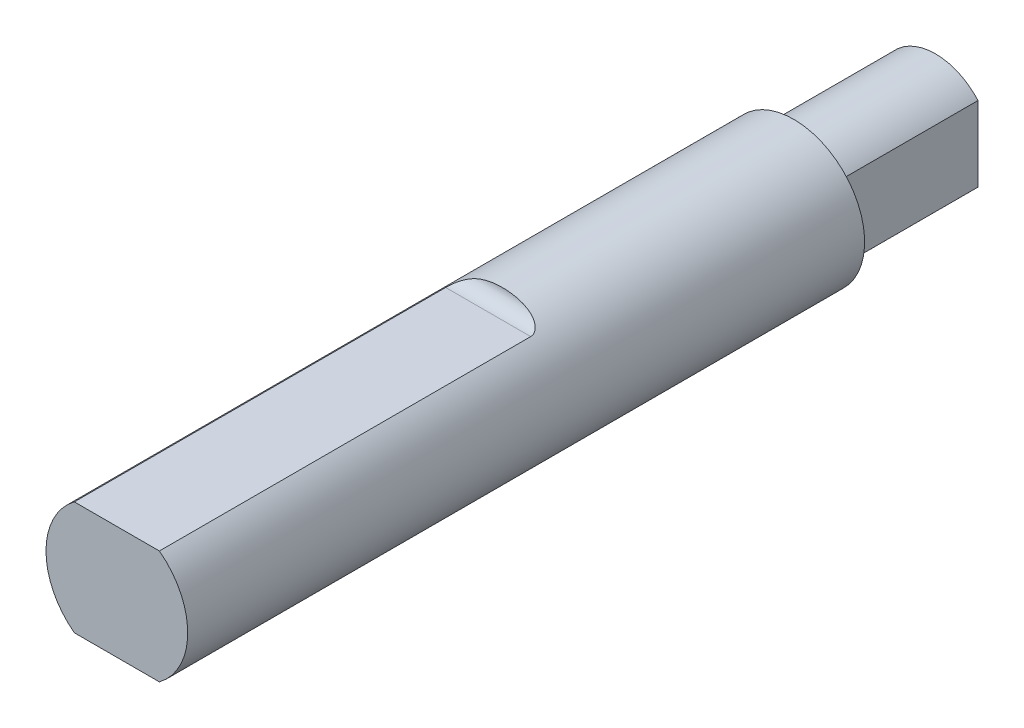
ISO-10303-21;
HEADER;
FILE_DESCRIPTION(('STEP AP214'),'2;1');
FILE_NAME('part.step','',(''),(''),'','','');
FILE_SCHEMA(('AUTOMOTIVE_DESIGN { 1 0 10303 214 1 1 1 1 }'));
ENDSEC;
DATA;
#1=APPLICATION_CONTEXT('core data for automotive mechanical design processes');
#2=APPLICATION_PROTOCOL_DEFINITION('international standard','automotive_design',2000,#1);
#3=PRODUCT_CONTEXT('',#1,'mechanical');
#4=PRODUCT('Part','Part','',(#3));
#5=PRODUCT_RELATED_PRODUCT_CATEGORY('part','',(#4));
#6=PRODUCT_DEFINITION_FORMATION('','',#4);
#7=PRODUCT_DEFINITION_CONTEXT('part definition',#1,'design');
#8=PRODUCT_DEFINITION('design','',#6,#7);
#9=PRODUCT_DEFINITION_SHAPE('','',#8);
#10=(LENGTH_UNIT() NAMED_UNIT(*) SI_UNIT(.MILLI.,.METRE.));
#11=(NAMED_UNIT(*) PLANE_ANGLE_UNIT() SI_UNIT($,.RADIAN.));
#12=(NAMED_UNIT(*) SI_UNIT($,.STERADIAN.) SOLID_ANGLE_UNIT());
#13=UNCERTAINTY_MEASURE_WITH_UNIT(LENGTH_MEASURE(1.E-05),#10,'distance_accuracy_value','');
#14=(GEOMETRIC_REPRESENTATION_CONTEXT(3) GLOBAL_UNCERTAINTY_ASSIGNED_CONTEXT((#13)) GLOBAL_UNIT_ASSIGNED_CONTEXT((#10,
#11,#12)) REPRESENTATION_CONTEXT('',''));
#15=CARTESIAN_POINT('',(0.,0.,0.));
#16=DIRECTION('',(0.,0.,1.));
#17=DIRECTION('',(1.,0.,0.));
#18=AXIS2_PLACEMENT_3D('',#15,#16,#17);
#19=CARTESIAN_POINT('',(0.,0.,28.879));
#20=DIRECTION('',(0.,0.,-1.));
#21=DIRECTION('',(-1.,0.,0.));
#22=AXIS2_PLACEMENT_3D('',#19,#20,#21);
#23=CYLINDRICAL_SURFACE('',#22,2.5);
#24=DIRECTION('',(0.,0.,1.));
#25=VECTOR('',#24,1.);
#26=CARTESIAN_POINT('',(-1.5,2.,15.779));
#27=LINE('',#26,#25);
#28=CARTESIAN_POINT('',(-1.5,2.,15.779));
#29=VERTEX_POINT('',#28);
#30=CARTESIAN_POINT('',(-1.5,2.,28.879));
#31=VERTEX_POINT('',#30);
#32=EDGE_CURVE('E63',#29,#31,#27,.T.);
#33=ORIENTED_EDGE('',*,*,#32,.F.);
#34=CARTESIAN_POINT('',(-1.5,2.,15.779));
#35=CARTESIAN_POINT('',(-1.50003764789676,1.99996204260842,15.7591270939918));
#36=CARTESIAN_POINT('',(-1.49842384435408,2.00118246531402,15.7393121678149));
#37=CARTESIAN_POINT('',(-1.49222650560307,2.00581270427297,15.7006130488765));
#38=CARTESIAN_POINT('',(-1.48767283056031,2.00920050346558,15.6817215300121));
#39=CARTESIAN_POINT('',(-1.47593572021465,2.01783617161018,15.645318845422));
#40=CARTESIAN_POINT('',(-1.46876053417294,2.02307820410837,15.6278035568533));
#41=CARTESIAN_POINT('',(-1.45219399215916,2.03500319732234,15.5943551798525));
#42=CARTESIAN_POINT('',(-1.44279713865559,2.04168972886228,15.5784261578861));
#43=CARTESIAN_POINT('',(-1.41781987066032,2.05915123933595,15.5418936731018));
#44=CARTESIAN_POINT('',(-1.40130908276452,2.07045575891846,15.5221823898567));
#45=CARTESIAN_POINT('',(-1.36562651076482,2.09416516504227,15.4861433388162));
#46=CARTESIAN_POINT('',(-1.34644955520267,2.10657217273916,15.4698223042075));
#47=CARTESIAN_POINT('',(-1.29422204293539,2.13925428967746,15.4313992900839));
#48=CARTESIAN_POINT('',(-1.25968293240487,2.15983618200008,15.4116007286691));
#49=CARTESIAN_POINT('',(-1.18753543304728,2.20033839558916,15.3778789861883));
#50=CARTESIAN_POINT('',(-1.1499202794411,2.22025711538361,15.3639691940692));
#51=CARTESIAN_POINT('',(-1.0753576538674,2.25725860017116,15.3413802680839));
#52=CARTESIAN_POINT('',(-1.03854738167487,2.27444227625866,15.3324034154042));
#53=CARTESIAN_POINT('',(-0.96362235810871,2.30718585547751,15.317320756555));
#54=CARTESIAN_POINT('',(-0.925506516753108,2.32274435564197,15.311217415323));
#55=CARTESIAN_POINT('',(-0.848234331199601,2.35206509731221,15.3011340715266));
#56=CARTESIAN_POINT('',(-0.809075990847351,2.36582354201172,15.2971585041484));
#57=CARTESIAN_POINT('',(-0.73000369223297,2.39140608562468,15.2907577129461));
#58=CARTESIAN_POINT('',(-0.690089500427336,2.40322957542402,15.2883329766199));
#59=CARTESIAN_POINT('',(-0.583695335636581,2.43187055653851,15.2833297945902));
#60=CARTESIAN_POINT('',(-0.516707751199021,2.44698125357976,15.2816635826573));
#61=CARTESIAN_POINT('',(-0.381680218624534,2.47164650838421,15.2796526372327));
#62=CARTESIAN_POINT('',(-0.313639732703522,2.48119812368875,15.2793086030396));
#63=CARTESIAN_POINT('',(-0.176894947888979,2.49468126945345,15.2789823404449));
#64=CARTESIAN_POINT('',(-0.10818978457339,2.49860407856408,15.2790006728511));
#65=CARTESIAN_POINT('',(0.0292885285896076,2.50077334188055,15.2789995207859));
#66=CARTESIAN_POINT('',(0.098061651711552,2.49902150622101,15.2789800477085));
#67=CARTESIAN_POINT('',(0.236189368361689,2.48979370240751,15.279082500772));
#68=CARTESIAN_POINT('',(0.305538646297269,2.48223803844602,15.2792064078503));
#69=CARTESIAN_POINT('',(0.443413184509917,2.46135085579352,15.2803859651072));
#70=CARTESIAN_POINT('',(0.511937799208332,2.44801508060984,15.2814423025259));
#71=CARTESIAN_POINT('',(0.647193526035153,2.41577096481712,15.2858782516794));
#72=CARTESIAN_POINT('',(0.713932477602935,2.39689394184407,15.2892449452257));
#73=CARTESIAN_POINT('',(0.845235409225721,2.35378975438525,15.3003329551466));
#74=CARTESIAN_POINT('',(0.909803301209289,2.32957288093341,15.3080459391723));
#75=CARTESIAN_POINT('',(1.00689724559128,2.28856751254539,15.3256358174016));
#76=CARTESIAN_POINT('',(1.04059295437449,2.27343566004815,15.3329168780388));
#77=CARTESIAN_POINT('',(1.10672545283644,2.24198499092013,15.3503358115405));
#78=CARTESIAN_POINT('',(1.13916133991401,2.22566534650348,15.3604756911685));
#79=CARTESIAN_POINT('',(1.20248836052356,2.19210295314736,15.3845013814871));
#80=CARTESIAN_POINT('',(1.23336626785886,2.17485426056167,15.3984143902443));
#81=CARTESIAN_POINT('',(1.29249277747563,2.14023972682707,15.430954183292));
#82=CARTESIAN_POINT('',(1.32074607515019,2.12287415690563,15.4495723190686));
#83=CARTESIAN_POINT('',(1.36369129375408,2.09540988527656,15.4847121544341));
#84=CARTESIAN_POINT('',(1.37956695997829,2.08497392165534,15.4995152181738));
#85=CARTESIAN_POINT('',(1.4092206933471,2.06504576865738,15.5316703225722));
#86=CARTESIAN_POINT('',(1.42300046190452,2.05555281595633,15.5490202729831));
#87=CARTESIAN_POINT('',(1.44584560582323,2.03953294763964,15.5833731471273));
#88=CARTESIAN_POINT('',(1.45531182404524,2.03277437722238,15.5999982476329));
#89=CARTESIAN_POINT('',(1.47181688912402,2.02085578581294,15.6349164154415));
#90=CARTESIAN_POINT('',(1.47886172980617,2.01569182083874,15.6532052202788));
#91=CARTESIAN_POINT('',(1.48951213878094,2.00783355471162,15.6891519913855));
#92=CARTESIAN_POINT('',(1.49339609193229,2.00494045583067,15.7066826682146));
#93=CARTESIAN_POINT('',(1.49866389863576,2.00100224145652,15.7424586097079));
#94=CARTESIAN_POINT('',(1.50002727049885,1.99997226674316,15.7607085083218));
#95=CARTESIAN_POINT('',(1.5,2.,15.779));
#96=B_SPLINE_CURVE_WITH_KNOTS('',3,(#34,#35,#36,#37,#38,#39,#40,#41,#42,#43,#44,#45,#46,#47,#48,
#49,#50,#51,#52,#53,#54,#55,#56,#57,#58,#59,#60,#61,#62,#63,#64,#65,#66,#67,#68,#69,#70,#71,#72,
#73,#74,#75,#76,#77,#78,#79,#80,#81,#82,#83,#84,#85,#86,#87,#88,#89,#90,#91,#92,#93,#94,#95),
.UNSPECIFIED.,.F.,.F.,(4,2,2,2,2,2,2,2,2,2,2,2,2,2,2,2,2,2,2,2,2,2,2,2,2,2,2,2,2,2,4),(0.,
0.0594240604100847,0.118253851146156,0.176900091122947,0.235692999194088,0.319483748208466,
0.403439351080197,0.537132622114268,0.671128252066819,0.7957551739251,0.920488808552722,
1.0454814384435,1.17051334001495,1.37630110705272,1.58219770008408,1.78841296891251,
1.99456609762952,2.20360178523934,2.41279166964385,2.62082131363628,2.82845349062703,
2.94128618701052,3.05419828496204,3.167946982397,3.28148809957396,3.35355280648448,
3.42555869666673,3.48619425822216,3.54667862420211,3.60096715275308,3.65569491121139),.UNSPECIFIED.);
#97=CARTESIAN_POINT('',(1.5,2.,15.779));
#98=VERTEX_POINT('',#97);
#99=EDGE_CURVE('E106',#29,#98,#96,.T.);
#100=ORIENTED_EDGE('',*,*,#99,.T.);
#101=DIRECTION('',(0.,0.,1.));
#102=VECTOR('',#101,1.);
#103=CARTESIAN_POINT('',(1.5,2.,15.779));
#104=LINE('',#103,#102);
#105=CARTESIAN_POINT('',(1.5,2.,28.879));
#106=VERTEX_POINT('',#105);
#107=EDGE_CURVE('E111',#98,#106,#104,.T.);
#108=ORIENTED_EDGE('',*,*,#107,.T.);
#109=CARTESIAN_POINT('',(0.,0.,28.879));
#110=DIRECTION('',(0.,0.,1.));
#111=DIRECTION('',(1.,0.,0.));
#112=AXIS2_PLACEMENT_3D('',#109,#110,#111);
#113=CIRCLE('',#112,2.5);
#114=CARTESIAN_POINT('',(1.5,-2.,28.879));
#115=VERTEX_POINT('',#114);
#116=EDGE_CURVE('E44',#115,#106,#113,.T.);
#117=ORIENTED_EDGE('',*,*,#116,.F.);
#118=DIRECTION('',(0.,0.,1.));
#119=VECTOR('',#118,1.);
#120=CARTESIAN_POINT('',(1.5,-2.,15.779));
#121=LINE('',#120,#119);
#122=CARTESIAN_POINT('',(1.5,-2.,15.779));
#123=VERTEX_POINT('',#122);
#124=EDGE_CURVE('E55',#123,#115,#121,.T.);
#125=ORIENTED_EDGE('',*,*,#124,.F.);
#126=CARTESIAN_POINT('',(1.5,-2.,15.779));
#127=CARTESIAN_POINT('',(1.50003764789676,-1.99996204260842,15.7591270939918));
#128=CARTESIAN_POINT('',(1.49842384435408,-2.00118246531402,15.7393121678149));
#129=CARTESIAN_POINT('',(1.49222650560307,-2.00581270427297,15.7006130488765));
#130=CARTESIAN_POINT('',(1.48767283056031,-2.00920050346558,15.6817215300121));
#131=CARTESIAN_POINT('',(1.47593572021465,-2.01783617161018,15.645318845422));
#132=CARTESIAN_POINT('',(1.46876053417294,-2.02307820410837,15.6278035568533));
#133=CARTESIAN_POINT('',(1.45219399215916,-2.03500319732234,15.5943551798525));
#134=CARTESIAN_POINT('',(1.44279713865559,-2.04168972886228,15.5784261578861));
#135=CARTESIAN_POINT('',(1.41781987066032,-2.05915123933595,15.5418936731018));
#136=CARTESIAN_POINT('',(1.40130908276452,-2.07045575891846,15.5221823898567));
#137=CARTESIAN_POINT('',(1.36562651076482,-2.09416516504227,15.4861433388162));
#138=CARTESIAN_POINT('',(1.34644955520267,-2.10657217273916,15.4698223042075));
#139=CARTESIAN_POINT('',(1.29422204293539,-2.13925428967746,15.4313992900839));
#140=CARTESIAN_POINT('',(1.25968293240487,-2.15983618200008,15.4116007286691));
#141=CARTESIAN_POINT('',(1.18753543304728,-2.20033839558916,15.3778789861883));
#142=CARTESIAN_POINT('',(1.1499202794411,-2.22025711538361,15.3639691940692));
#143=CARTESIAN_POINT('',(1.0753576538674,-2.25725860017116,15.3413802680839));
#144=CARTESIAN_POINT('',(1.03854738167487,-2.27444227625866,15.3324034154042));
#145=CARTESIAN_POINT('',(0.96362235810871,-2.30718585547751,15.317320756555));
#146=CARTESIAN_POINT('',(0.925506516753108,-2.32274435564197,15.311217415323));
#147=CARTESIAN_POINT('',(0.848234331199601,-2.35206509731221,15.3011340715266));
#148=CARTESIAN_POINT('',(0.809075990847351,-2.36582354201172,15.2971585041484));
#149=CARTESIAN_POINT('',(0.73000369223297,-2.39140608562468,15.2907577129461));
#150=CARTESIAN_POINT('',(0.690089500427336,-2.40322957542402,15.2883329766199));
#151=CARTESIAN_POINT('',(0.583695335636581,-2.43187055653851,15.2833297945902));
#152=CARTESIAN_POINT('',(0.516707751199021,-2.44698125357976,15.2816635826573));
#153=CARTESIAN_POINT('',(0.381680218624534,-2.47164650838421,15.2796526372327));
#154=CARTESIAN_POINT('',(0.313639732703522,-2.48119812368875,15.2793086030396));
#155=CARTESIAN_POINT('',(0.176894947888979,-2.49468126945345,15.2789823404449));
#156=CARTESIAN_POINT('',(0.10818978457339,-2.49860407856408,15.2790006728511));
#157=CARTESIAN_POINT('',(-0.0292885285896076,-2.50077334188055,15.2789995207859));
#158=CARTESIAN_POINT('',(-0.098061651711552,-2.49902150622101,15.2789800477085));
#159=CARTESIAN_POINT('',(-0.236189368361689,-2.48979370240751,15.279082500772));
#160=CARTESIAN_POINT('',(-0.305538646297269,-2.48223803844602,15.2792064078503));
#161=CARTESIAN_POINT('',(-0.443413184509917,-2.46135085579352,15.2803859651072));
#162=CARTESIAN_POINT('',(-0.511937799208332,-2.44801508060984,15.2814423025259));
#163=CARTESIAN_POINT('',(-0.647193526035153,-2.41577096481712,15.2858782516794));
#164=CARTESIAN_POINT('',(-0.713932477602935,-2.39689394184407,15.2892449452257));
#165=CARTESIAN_POINT('',(-0.845235409225721,-2.35378975438525,15.3003329551466));
#166=CARTESIAN_POINT('',(-0.909803301209289,-2.32957288093341,15.3080459391723));
#167=CARTESIAN_POINT('',(-1.00689724559128,-2.28856751254539,15.3256358174016));
#168=CARTESIAN_POINT('',(-1.04059295437449,-2.27343566004815,15.3329168780388));
#169=CARTESIAN_POINT('',(-1.10672545283644,-2.24198499092013,15.3503358115405));
#170=CARTESIAN_POINT('',(-1.13916133991401,-2.22566534650348,15.3604756911685));
#171=CARTESIAN_POINT('',(-1.20248836052356,-2.19210295314736,15.3845013814871));
#172=CARTESIAN_POINT('',(-1.23336626785886,-2.17485426056167,15.3984143902443));
#173=CARTESIAN_POINT('',(-1.29249277747563,-2.14023972682707,15.430954183292));
#174=CARTESIAN_POINT('',(-1.32074607515019,-2.12287415690563,15.4495723190686));
#175=CARTESIAN_POINT('',(-1.36369129375408,-2.09540988527656,15.4847121544341));
#176=CARTESIAN_POINT('',(-1.37956695997829,-2.08497392165534,15.4995152181738));
#177=CARTESIAN_POINT('',(-1.4092206933471,-2.06504576865738,15.5316703225722));
#178=CARTESIAN_POINT('',(-1.42300046190452,-2.05555281595633,15.5490202729831));
#179=CARTESIAN_POINT('',(-1.44584560582323,-2.03953294763964,15.5833731471273));
#180=CARTESIAN_POINT('',(-1.45531182404524,-2.03277437722238,15.5999982476329));
#181=CARTESIAN_POINT('',(-1.47181688912402,-2.02085578581294,15.6349164154415));
#182=CARTESIAN_POINT('',(-1.47886172980617,-2.01569182083874,15.6532052202788));
#183=CARTESIAN_POINT('',(-1.48951213878094,-2.00783355471162,15.6891519913855));
#184=CARTESIAN_POINT('',(-1.49339609193229,-2.00494045583067,15.7066826682146));
#185=CARTESIAN_POINT('',(-1.49866389863576,-2.00100224145652,15.7424586097079));
#186=CARTESIAN_POINT('',(-1.50002727049885,-1.99997226674316,15.7607085083218));
#187=CARTESIAN_POINT('',(-1.5,-2.,15.779));
#188=B_SPLINE_CURVE_WITH_KNOTS('',3,(#126,#127,#128,#129,#130,#131,#132,#133,#134,#135,#136,
#137,#138,#139,#140,#141,#142,#143,#144,#145,#146,#147,#148,#149,#150,#151,#152,#153,#154,#155,
#156,#157,#158,#159,#160,#161,#162,#163,#164,#165,#166,#167,#168,#169,#170,#171,#172,#173,#174,
#175,#176,#177,#178,#179,#180,#181,#182,#183,#184,#185,#186,#187),.UNSPECIFIED.,.F.,.F.,(4,2,2,
2,2,2,2,2,2,2,2,2,2,2,2,2,2,2,2,2,2,2,2,2,2,2,2,2,2,2,4),(0.,0.0594240604100847,
0.118253851146156,0.176900091122947,0.235692999194088,0.319483748208466,0.403439351080197,
0.537132622114268,0.671128252066819,0.7957551739251,0.920488808552722,1.0454814384435,
1.17051334001495,1.37630110705272,1.58219770008408,1.78841296891251,1.99456609762952,
2.20360178523934,2.41279166964385,2.62082131363628,2.82845349062703,2.94128618701052,
3.05419828496204,3.167946982397,3.28148809957396,3.35355280648448,3.42555869666673,
3.48619425822216,3.54667862420211,3.60096715275308,3.65569491121139),.UNSPECIFIED.);
#189=CARTESIAN_POINT('',(-1.5,-2.,15.779));
#190=VERTEX_POINT('',#189);
#191=EDGE_CURVE('E115',#123,#190,#188,.T.);
#192=ORIENTED_EDGE('',*,*,#191,.T.);
#193=DIRECTION('',(0.,0.,1.));
#194=VECTOR('',#193,1.);
#195=CARTESIAN_POINT('',(-1.5,-2.,15.779));
#196=LINE('',#195,#194);
#197=CARTESIAN_POINT('',(-1.5,-2.,28.879));
#198=VERTEX_POINT('',#197);
#199=EDGE_CURVE('E132',#190,#198,#196,.T.);
#200=ORIENTED_EDGE('',*,*,#199,.T.);
#201=EDGE_CURVE('E11',#31,#198,#113,.T.);
#202=ORIENTED_EDGE('',*,*,#201,.F.);
#203=EDGE_LOOP('',(#33,#100,#108,#117,#125,#192,#200,#202));
#204=FACE_BOUND('',#203,.T.);
#205=CARTESIAN_POINT('',(0.,0.,5.));
#206=DIRECTION('',(0.,0.,-1.));
#207=DIRECTION('',(-1.,0.,0.));
#208=AXIS2_PLACEMENT_3D('',#205,#206,#207);
#209=CIRCLE('',#208,2.5);
#210=CARTESIAN_POINT('',(-2.5,0.,5.));
#211=VERTEX_POINT('',#210);
#212=EDGE_CURVE('E162',#211,#211,#209,.T.);
#213=ORIENTED_EDGE('',*,*,#212,.F.);
#214=EDGE_LOOP('',(#213));
#215=FACE_BOUND('',#214,.T.);
#216=ADVANCED_FACE('F40',(#204,#215),#23,.T.);
#217=CARTESIAN_POINT('',(0.,0.,28.879));
#218=DIRECTION('',(0.,0.,1.));
#219=DIRECTION('',(1.,0.,0.));
#220=AXIS2_PLACEMENT_3D('',#217,#218,#219);
#221=PLANE('',#220);
#222=DIRECTION('',(1.,0.,0.));
#223=VECTOR('',#222,1.);
#224=CARTESIAN_POINT('',(-1.5,2.,28.879));
#225=LINE('',#224,#223);
#226=EDGE_CURVE('E119',#31,#106,#225,.T.);
#227=ORIENTED_EDGE('',*,*,#226,.F.);
#228=ORIENTED_EDGE('',*,*,#201,.T.);
#229=DIRECTION('',(-1.,0.,0.));
#230=VECTOR('',#229,1.);
#231=CARTESIAN_POINT('',(-1.5,-2.,28.879));
#232=LINE('',#231,#230);
#233=EDGE_CURVE('E135',#115,#198,#232,.T.);
#234=ORIENTED_EDGE('',*,*,#233,.F.);
#235=ORIENTED_EDGE('',*,*,#116,.T.);
#236=EDGE_LOOP('',(#227,#228,#234,#235));
#237=FACE_BOUND('',#236,.T.);
#238=ADVANCED_FACE('F172',(#237),#221,.T.);
#239=CARTESIAN_POINT('',(0.,0.,5.));
#240=DIRECTION('',(0.,0.,-1.));
#241=DIRECTION('',(-1.,0.,0.));
#242=AXIS2_PLACEMENT_3D('',#239,#240,#241);
#243=PLANE('',#242);
#244=DIRECTION('',(0.,1.,0.));
#245=VECTOR('',#244,1.);
#246=CARTESIAN_POINT('',(-1.5,-1.3228756555323,5.));
#247=LINE('',#246,#245);
#248=CARTESIAN_POINT('',(-1.5,-1.32287565553229,5.));
#249=VERTEX_POINT('',#248);
#250=CARTESIAN_POINT('',(-1.5,1.3228756555323,5.));
#251=VERTEX_POINT('',#250);
#252=EDGE_CURVE('E149',#249,#251,#247,.T.);
#253=ORIENTED_EDGE('',*,*,#252,.F.);
#254=CARTESIAN_POINT('',(0.,0.,5.));
#255=DIRECTION('',(0.,0.,-1.));
#256=DIRECTION('',(-1.,0.,0.));
#257=AXIS2_PLACEMENT_3D('',#254,#255,#256);
#258=CIRCLE('',#257,2.);
#259=CARTESIAN_POINT('',(1.5,-1.32287565553229,5.));
#260=VERTEX_POINT('',#259);
#261=EDGE_CURVE('E146',#260,#249,#258,.T.);
#262=ORIENTED_EDGE('',*,*,#261,.F.);
#263=DIRECTION('',(0.,-1.,0.));
#264=VECTOR('',#263,1.);
#265=CARTESIAN_POINT('',(1.5,1.32287565553229,5.));
#266=LINE('',#265,#264);
#267=CARTESIAN_POINT('',(1.5,1.32287565553229,5.));
#268=VERTEX_POINT('',#267);
#269=EDGE_CURVE('E142',#268,#260,#266,.T.);
#270=ORIENTED_EDGE('',*,*,#269,.F.);
#271=CARTESIAN_POINT('',(0.,0.,5.));
#272=DIRECTION('',(0.,0.,-1.));
#273=DIRECTION('',(1.,0.,0.));
#274=AXIS2_PLACEMENT_3D('',#271,#272,#273);
#275=CIRCLE('',#274,2.);
#276=EDGE_CURVE('E139',#251,#268,#275,.T.);
#277=ORIENTED_EDGE('',*,*,#276,.F.);
#278=EDGE_LOOP('',(#253,#262,#270,#277));
#279=FACE_BOUND('',#278,.T.);
#280=ORIENTED_EDGE('',*,*,#212,.T.);
#281=EDGE_LOOP('',(#280));
#282=FACE_BOUND('',#281,.T.);
#283=ADVANCED_FACE('F193',(#279,#282),#243,.T.);
#284=CARTESIAN_POINT('',(0.,0.,5.));
#285=DIRECTION('',(0.,0.,-1.));
#286=DIRECTION('',(-1.,0.,0.));
#287=AXIS2_PLACEMENT_3D('',#284,#285,#286);
#288=CYLINDRICAL_SURFACE('',#287,2.);
#289=CARTESIAN_POINT('',(0.,0.,0.));
#290=DIRECTION('',(0.,0.,-1.));
#291=DIRECTION('',(1.,0.,0.));
#292=AXIS2_PLACEMENT_3D('',#289,#290,#291);
#293=CIRCLE('',#292,2.);
#294=CARTESIAN_POINT('',(-1.5,1.3228756555323,0.));
#295=VERTEX_POINT('',#294);
#296=CARTESIAN_POINT('',(1.5,1.32287565553229,0.));
#297=VERTEX_POINT('',#296);
#298=EDGE_CURVE('E122',#295,#297,#293,.T.);
#299=ORIENTED_EDGE('',*,*,#298,.F.);
#300=DIRECTION('',(0.,0.,-1.));
#301=VECTOR('',#300,1.);
#302=CARTESIAN_POINT('',(-1.5,1.3228756555323,5.));
#303=LINE('',#302,#301);
#304=EDGE_CURVE('E160',#251,#295,#303,.T.);
#305=ORIENTED_EDGE('',*,*,#304,.F.);
#306=ORIENTED_EDGE('',*,*,#276,.T.);
#307=DIRECTION('',(0.,0.,-1.));
#308=VECTOR('',#307,1.);
#309=CARTESIAN_POINT('',(1.5,1.32287565553229,5.));
#310=LINE('',#309,#308);
#311=EDGE_CURVE('E151',#268,#297,#310,.T.);
#312=ORIENTED_EDGE('',*,*,#311,.T.);
#313=EDGE_LOOP('',(#299,#305,#306,#312));
#314=FACE_BOUND('',#313,.T.);
#315=ADVANCED_FACE('F198',(#314),#288,.T.);
#316=CARTESIAN_POINT('',(-1.5,-1.3228756555323,5.));
#317=DIRECTION('',(-1.,0.,0.));
#318=DIRECTION('',(0.,0.,1.));
#319=AXIS2_PLACEMENT_3D('',#316,#317,#318);
#320=PLANE('',#319);
#321=DIRECTION('',(0.,1.,0.));
#322=VECTOR('',#321,1.);
#323=CARTESIAN_POINT('',(-1.5,-1.3228756555323,0.));
#324=LINE('',#323,#322);
#325=CARTESIAN_POINT('',(-1.5,-1.32287565553229,0.));
#326=VERTEX_POINT('',#325);
#327=EDGE_CURVE('E143',#326,#295,#324,.T.);
#328=ORIENTED_EDGE('',*,*,#327,.F.);
#329=DIRECTION('',(0.,0.,-1.));
#330=VECTOR('',#329,1.);
#331=CARTESIAN_POINT('',(-1.5,-1.32287565553229,5.));
#332=LINE('',#331,#330);
#333=EDGE_CURVE('E163',#249,#326,#332,.T.);
#334=ORIENTED_EDGE('',*,*,#333,.F.);
#335=ORIENTED_EDGE('',*,*,#252,.T.);
#336=ORIENTED_EDGE('',*,*,#304,.T.);
#337=EDGE_LOOP('',(#328,#334,#335,#336));
#338=FACE_BOUND('',#337,.T.);
#339=ADVANCED_FACE('F204',(#338),#320,.T.);
#340=CARTESIAN_POINT('',(0.,0.,5.));
#341=DIRECTION('',(0.,0.,-1.));
#342=DIRECTION('',(-1.,0.,0.));
#343=AXIS2_PLACEMENT_3D('',#340,#341,#342);
#344=CYLINDRICAL_SURFACE('',#343,2.);
#345=CARTESIAN_POINT('',(0.,0.,0.));
#346=DIRECTION('',(0.,0.,-1.));
#347=DIRECTION('',(-1.,0.,0.));
#348=AXIS2_PLACEMENT_3D('',#345,#346,#347);
#349=CIRCLE('',#348,2.);
#350=CARTESIAN_POINT('',(1.5,-1.32287565553229,0.));
#351=VERTEX_POINT('',#350);
#352=EDGE_CURVE('E155',#351,#326,#349,.T.);
#353=ORIENTED_EDGE('',*,*,#352,.F.);
#354=DIRECTION('',(0.,0.,-1.));
#355=VECTOR('',#354,1.);
#356=CARTESIAN_POINT('',(1.5,-1.32287565553229,5.));
#357=LINE('',#356,#355);
#358=EDGE_CURVE('E165',#260,#351,#357,.T.);
#359=ORIENTED_EDGE('',*,*,#358,.F.);
#360=ORIENTED_EDGE('',*,*,#261,.T.);
#361=ORIENTED_EDGE('',*,*,#333,.T.);
#362=EDGE_LOOP('',(#353,#359,#360,#361));
#363=FACE_BOUND('',#362,.T.);
#364=ADVANCED_FACE('F208',(#363),#344,.T.);
#365=CARTESIAN_POINT('',(1.5,1.32287565553229,5.));
#366=DIRECTION('',(1.,0.,0.));
#367=DIRECTION('',(0.,0.,-1.));
#368=AXIS2_PLACEMENT_3D('',#365,#366,#367);
#369=PLANE('',#368);
#370=DIRECTION('',(0.,-1.,0.));
#371=VECTOR('',#370,1.);
#372=CARTESIAN_POINT('',(1.5,1.32287565553229,0.));
#373=LINE('',#372,#371);
#374=EDGE_CURVE('E125',#297,#351,#373,.T.);
#375=ORIENTED_EDGE('',*,*,#374,.F.);
#376=ORIENTED_EDGE('',*,*,#311,.F.);
#377=ORIENTED_EDGE('',*,*,#269,.T.);
#378=ORIENTED_EDGE('',*,*,#358,.T.);
#379=EDGE_LOOP('',(#375,#376,#377,#378));
#380=FACE_BOUND('',#379,.T.);
#381=ADVANCED_FACE('F186',(#380),#369,.T.);
#382=CARTESIAN_POINT('',(0.,0.,0.));
#383=DIRECTION('',(0.,0.,1.));
#384=DIRECTION('',(1.,0.,0.));
#385=AXIS2_PLACEMENT_3D('',#382,#383,#384);
#386=PLANE('',#385);
#387=ORIENTED_EDGE('',*,*,#298,.T.);
#388=ORIENTED_EDGE('',*,*,#374,.T.);
#389=ORIENTED_EDGE('',*,*,#352,.T.);
#390=ORIENTED_EDGE('',*,*,#327,.T.);
#391=EDGE_LOOP('',(#387,#388,#389,#390));
#392=FACE_BOUND('',#391,.T.);
#393=ADVANCED_FACE('F179',(#392),#386,.F.);
#394=CARTESIAN_POINT('',(-1.5,-2.,15.779));
#395=DIRECTION('',(0.,1.,0.));
#396=DIRECTION('',(0.,0.,1.));
#397=AXIS2_PLACEMENT_3D('',#394,#395,#396);
#398=PLANE('',#397);
#399=ORIENTED_EDGE('',*,*,#233,.T.);
#400=ORIENTED_EDGE('',*,*,#199,.F.);
#401=DIRECTION('',(-1.,0.,0.));
#402=VECTOR('',#401,1.);
#403=CARTESIAN_POINT('',(-1.5,-2.,15.779));
#404=LINE('',#403,#402);
#405=EDGE_CURVE('E131',#123,#190,#404,.T.);
#406=ORIENTED_EDGE('',*,*,#405,.F.);
#407=ORIENTED_EDGE('',*,*,#124,.T.);
#408=EDGE_LOOP('',(#399,#400,#406,#407));
#409=FACE_BOUND('',#408,.T.);
#410=ADVANCED_FACE('F177',(#409),#398,.F.);
#411=CARTESIAN_POINT('',(-1.5,2.,15.779));
#412=DIRECTION('',(0.,-1.,0.));
#413=DIRECTION('',(0.,0.,-1.));
#414=AXIS2_PLACEMENT_3D('',#411,#412,#413);
#415=PLANE('',#414);
#416=ORIENTED_EDGE('',*,*,#226,.T.);
#417=ORIENTED_EDGE('',*,*,#107,.F.);
#418=DIRECTION('',(1.,0.,0.));
#419=VECTOR('',#418,1.);
#420=CARTESIAN_POINT('',(-1.5,2.,15.779));
#421=LINE('',#420,#419);
#422=EDGE_CURVE('E117',#29,#98,#421,.T.);
#423=ORIENTED_EDGE('',*,*,#422,.F.);
#424=ORIENTED_EDGE('',*,*,#32,.T.);
#425=EDGE_LOOP('',(#416,#417,#423,#424));
#426=FACE_BOUND('',#425,.T.);
#427=ADVANCED_FACE('F121',(#426),#415,.F.);
#428=CARTESIAN_POINT('',(-2.5,2.5,15.779));
#429=DIRECTION('',(1.,0.,0.));
#430=DIRECTION('',(0.,0.,-1.));
#431=AXIS2_PLACEMENT_3D('',#428,#429,#430);
#432=CYLINDRICAL_SURFACE('',#431,0.5);
#433=ORIENTED_EDGE('',*,*,#422,.T.);
#434=ORIENTED_EDGE('',*,*,#99,.F.);
#435=EDGE_LOOP('',(#433,#434));
#436=FACE_BOUND('',#435,.T.);
#437=ADVANCED_FACE('F118',(#436),#432,.F.);
#438=CARTESIAN_POINT('',(-2.5,-2.5,15.779));
#439=DIRECTION('',(1.,0.,0.));
#440=DIRECTION('',(0.,0.,-1.));
#441=AXIS2_PLACEMENT_3D('',#438,#439,#440);
#442=CYLINDRICAL_SURFACE('',#441,0.5);
#443=ORIENTED_EDGE('',*,*,#405,.T.);
#444=ORIENTED_EDGE('',*,*,#191,.F.);
#445=EDGE_LOOP('',(#443,#444));
#446=FACE_BOUND('',#445,.T.);
#447=ADVANCED_FACE('F176',(#446),#442,.F.);
#448=CLOSED_SHELL('',(#216,#238,#283,#315,#339,#364,#381,#393,#410,#427,#437,#447));
#449=MANIFOLD_SOLID_BREP('B2',#448);
#450=ADVANCED_BREP_SHAPE_REPRESENTATION('',(#18,#449),#14);
#451=SHAPE_DEFINITION_REPRESENTATION(#9,#450);
ENDSEC;
END-ISO-10303-21;
